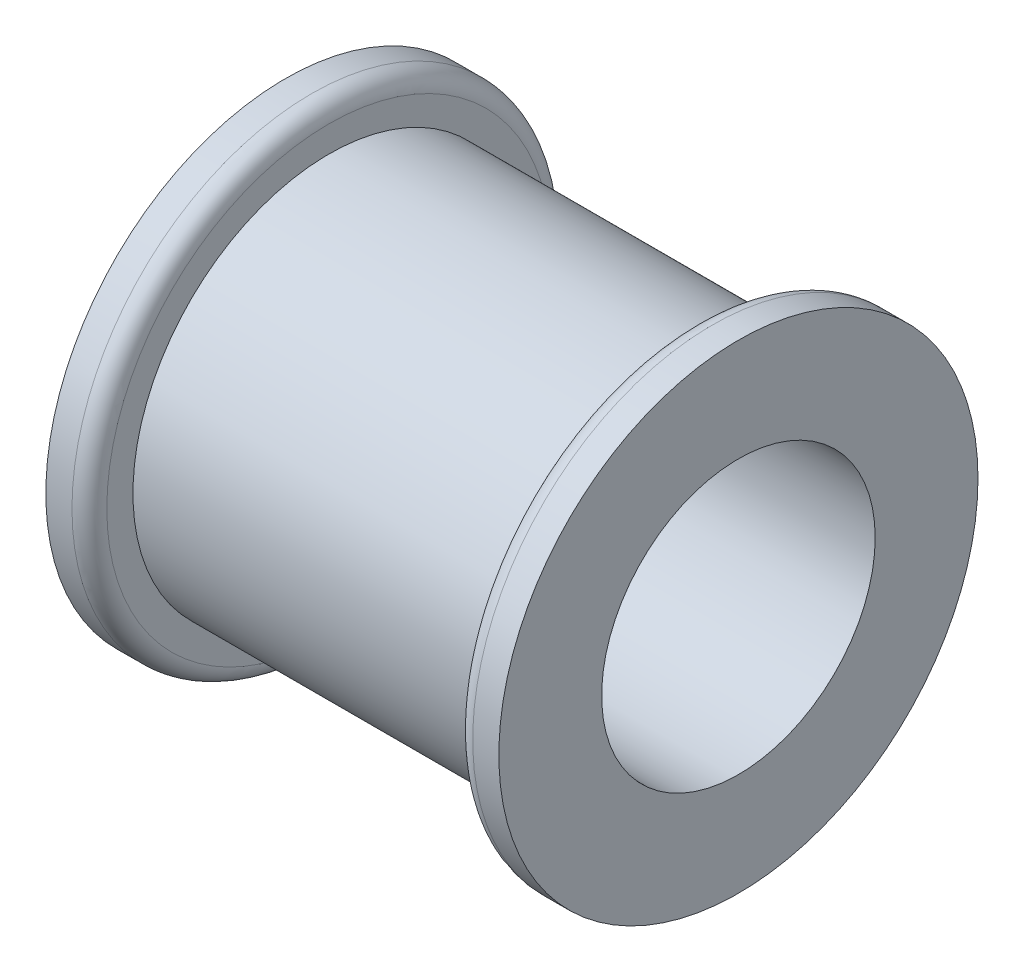
ISO-10303-21;
HEADER;
FILE_DESCRIPTION(('STEP AP214'),'2;1');
FILE_NAME('part.step','',(''),(''),'','','');
FILE_SCHEMA(('AUTOMOTIVE_DESIGN { 1 0 10303 214 1 1 1 1 }'));
ENDSEC;
DATA;
#1=APPLICATION_CONTEXT('core data for automotive mechanical design processes');
#2=APPLICATION_PROTOCOL_DEFINITION('international standard','automotive_design',2000,#1);
#3=PRODUCT_CONTEXT('',#1,'mechanical');
#4=PRODUCT('Part','Part','',(#3));
#5=PRODUCT_RELATED_PRODUCT_CATEGORY('part','',(#4));
#6=PRODUCT_DEFINITION_FORMATION('','',#4);
#7=PRODUCT_DEFINITION_CONTEXT('part definition',#1,'design');
#8=PRODUCT_DEFINITION('design','',#6,#7);
#9=PRODUCT_DEFINITION_SHAPE('','',#8);
#10=(LENGTH_UNIT() NAMED_UNIT(*) SI_UNIT(.MILLI.,.METRE.));
#11=(NAMED_UNIT(*) PLANE_ANGLE_UNIT() SI_UNIT($,.RADIAN.));
#12=(NAMED_UNIT(*) SI_UNIT($,.STERADIAN.) SOLID_ANGLE_UNIT());
#13=UNCERTAINTY_MEASURE_WITH_UNIT(LENGTH_MEASURE(1.E-05),#10,'distance_accuracy_value','');
#14=(GEOMETRIC_REPRESENTATION_CONTEXT(3) GLOBAL_UNCERTAINTY_ASSIGNED_CONTEXT((#13)) GLOBAL_UNIT_ASSIGNED_CONTEXT((#10,
#11,#12)) REPRESENTATION_CONTEXT('',''));
#15=CARTESIAN_POINT('',(0.,0.,0.));
#16=DIRECTION('',(0.,0.,1.));
#17=DIRECTION('',(1.,0.,0.));
#18=AXIS2_PLACEMENT_3D('',#15,#16,#17);
#19=CARTESIAN_POINT('',(26.67,0.,0.));
#20=DIRECTION('',(-1.,0.,0.));
#21=DIRECTION('',(0.,0.,1.));
#22=AXIS2_PLACEMENT_3D('',#19,#20,#21);
#23=CYLINDRICAL_SURFACE('',#22,14.2875);
#24=CARTESIAN_POINT('',(26.67,0.,0.));
#25=DIRECTION('',(1.,0.,0.));
#26=DIRECTION('',(0.,0.,-1.));
#27=AXIS2_PLACEMENT_3D('',#24,#25,#26);
#28=CIRCLE('',#27,14.2875);
#29=CARTESIAN_POINT('',(26.67,0.,-14.2875));
#30=VERTEX_POINT('',#29);
#31=EDGE_CURVE('E50',#30,#30,#28,.T.);
#32=ORIENTED_EDGE('',*,*,#31,.F.);
#33=EDGE_LOOP('',(#32));
#34=FACE_BOUND('',#33,.T.);
#35=CARTESIAN_POINT('',(0.,0.,0.));
#36=DIRECTION('',(1.,0.,0.));
#37=DIRECTION('',(0.,0.,-1.));
#38=AXIS2_PLACEMENT_3D('',#35,#36,#37);
#39=CIRCLE('',#38,14.2875);
#40=CARTESIAN_POINT('',(0.,0.,-14.2875));
#41=VERTEX_POINT('',#40);
#42=EDGE_CURVE('E51',#41,#41,#39,.T.);
#43=ORIENTED_EDGE('',*,*,#42,.T.);
#44=EDGE_LOOP('',(#43));
#45=FACE_BOUND('',#44,.T.);
#46=ADVANCED_FACE('F30',(#34,#45),#23,.T.);
#47=CARTESIAN_POINT('',(26.67,0.,0.));
#48=DIRECTION('',(-1.,0.,0.));
#49=DIRECTION('',(0.,0.,1.));
#50=AXIS2_PLACEMENT_3D('',#47,#48,#49);
#51=CYLINDRICAL_SURFACE('',#50,9.9695);
#52=CARTESIAN_POINT('',(29.845,0.,0.));
#53=DIRECTION('',(1.,0.,0.));
#54=DIRECTION('',(0.,0.,-1.));
#55=AXIS2_PLACEMENT_3D('',#52,#53,#54);
#56=CIRCLE('',#55,9.9695);
#57=CARTESIAN_POINT('',(29.845,0.,-9.9695));
#58=VERTEX_POINT('',#57);
#59=EDGE_CURVE('E54',#58,#58,#56,.T.);
#60=ORIENTED_EDGE('',*,*,#59,.T.);
#61=EDGE_LOOP('',(#60));
#62=FACE_BOUND('',#61,.T.);
#63=CARTESIAN_POINT('',(-3.175,0.,0.));
#64=DIRECTION('',(1.,0.,0.));
#65=DIRECTION('',(0.,0.,-1.));
#66=AXIS2_PLACEMENT_3D('',#63,#64,#65);
#67=CIRCLE('',#66,9.9695);
#68=CARTESIAN_POINT('',(-3.175,0.,-9.9695));
#69=VERTEX_POINT('',#68);
#70=EDGE_CURVE('E65',#69,#69,#67,.T.);
#71=ORIENTED_EDGE('',*,*,#70,.F.);
#72=EDGE_LOOP('',(#71));
#73=FACE_BOUND('',#72,.T.);
#74=ADVANCED_FACE('F72',(#62,#73),#51,.F.);
#75=CARTESIAN_POINT('',(29.845,0.,0.));
#76=DIRECTION('',(1.,0.,0.));
#77=DIRECTION('',(0.,0.,-1.));
#78=AXIS2_PLACEMENT_3D('',#75,#76,#77);
#79=PLANE('',#78);
#80=CARTESIAN_POINT('',(29.845,0.,0.));
#81=DIRECTION('',(1.,0.,0.));
#82=DIRECTION('',(0.,0.,-1.));
#83=AXIS2_PLACEMENT_3D('',#80,#81,#82);
#84=CIRCLE('',#83,17.4625);
#85=CARTESIAN_POINT('',(29.845,0.,-17.4625));
#86=VERTEX_POINT('',#85);
#87=EDGE_CURVE('E58',#86,#86,#84,.T.);
#88=ORIENTED_EDGE('',*,*,#87,.T.);
#89=EDGE_LOOP('',(#88));
#90=FACE_BOUND('',#89,.T.);
#91=ORIENTED_EDGE('',*,*,#59,.F.);
#92=EDGE_LOOP('',(#91));
#93=FACE_BOUND('',#92,.T.);
#94=ADVANCED_FACE('F74',(#90,#93),#79,.T.);
#95=CARTESIAN_POINT('',(26.67,0.,0.));
#96=DIRECTION('',(1.,0.,0.));
#97=DIRECTION('',(0.,0.,-1.));
#98=AXIS2_PLACEMENT_3D('',#95,#96,#97);
#99=PLANE('',#98);
#100=CARTESIAN_POINT('',(26.67,0.,0.));
#101=DIRECTION('',(1.,0.,0.));
#102=DIRECTION('',(0.,0.,-1.));
#103=AXIS2_PLACEMENT_3D('',#100,#101,#102);
#104=CIRCLE('',#103,16.1925);
#105=CARTESIAN_POINT('',(26.67,0.,-16.1925));
#106=VERTEX_POINT('',#105);
#107=EDGE_CURVE('E41',#106,#106,#104,.F.);
#108=ORIENTED_EDGE('',*,*,#107,.T.);
#109=EDGE_LOOP('',(#108));
#110=FACE_BOUND('',#109,.T.);
#111=ORIENTED_EDGE('',*,*,#31,.T.);
#112=EDGE_LOOP('',(#111));
#113=FACE_BOUND('',#112,.T.);
#114=ADVANCED_FACE('F81',(#110,#113),#99,.F.);
#115=CARTESIAN_POINT('',(29.845,0.,0.));
#116=DIRECTION('',(-1.,0.,0.));
#117=DIRECTION('',(0.,0.,1.));
#118=AXIS2_PLACEMENT_3D('',#115,#116,#117);
#119=CYLINDRICAL_SURFACE('',#118,17.4625);
#120=CARTESIAN_POINT('',(27.94,0.,0.));
#121=DIRECTION('',(1.,0.,0.));
#122=DIRECTION('',(0.,0.,-1.));
#123=AXIS2_PLACEMENT_3D('',#120,#121,#122);
#124=CIRCLE('',#123,17.4625);
#125=CARTESIAN_POINT('',(27.94,0.,-17.4625));
#126=VERTEX_POINT('',#125);
#127=EDGE_CURVE('E45',#126,#126,#124,.T.);
#128=ORIENTED_EDGE('',*,*,#127,.T.);
#129=EDGE_LOOP('',(#128));
#130=FACE_BOUND('',#129,.T.);
#131=ORIENTED_EDGE('',*,*,#87,.F.);
#132=EDGE_LOOP('',(#131));
#133=FACE_BOUND('',#132,.T.);
#134=ADVANCED_FACE('F87',(#130,#133),#119,.T.);
#135=CARTESIAN_POINT('',(27.94,0.,0.));
#136=DIRECTION('',(1.,0.,0.));
#137=DIRECTION('',(0.,0.,-1.));
#138=AXIS2_PLACEMENT_3D('',#135,#136,#137);
#139=TOROIDAL_SURFACE('',#138,16.1925,1.27);
#140=ORIENTED_EDGE('',*,*,#107,.F.);
#141=EDGE_LOOP('',(#140));
#142=FACE_BOUND('',#141,.T.);
#143=ORIENTED_EDGE('',*,*,#127,.F.);
#144=EDGE_LOOP('',(#143));
#145=FACE_BOUND('',#144,.T.);
#146=ADVANCED_FACE('F89',(#142,#145),#139,.T.);
#147=CARTESIAN_POINT('',(-3.175,0.,0.));
#148=DIRECTION('',(1.,0.,0.));
#149=DIRECTION('',(0.,0.,-1.));
#150=AXIS2_PLACEMENT_3D('',#147,#148,#149);
#151=CYLINDRICAL_SURFACE('',#150,17.4625);
#152=CARTESIAN_POINT('',(-1.27,0.,0.));
#153=DIRECTION('',(-1.,0.,0.));
#154=DIRECTION('',(0.,0.,1.));
#155=AXIS2_PLACEMENT_3D('',#152,#153,#154);
#156=CIRCLE('',#155,17.4625);
#157=CARTESIAN_POINT('',(-1.27,0.,17.4625));
#158=VERTEX_POINT('',#157);
#159=EDGE_CURVE('E10',#158,#158,#156,.T.);
#160=ORIENTED_EDGE('',*,*,#159,.T.);
#161=EDGE_LOOP('',(#160));
#162=FACE_BOUND('',#161,.T.);
#163=CARTESIAN_POINT('',(-3.175,0.,0.));
#164=DIRECTION('',(1.,0.,0.));
#165=DIRECTION('',(0.,0.,-1.));
#166=AXIS2_PLACEMENT_3D('',#163,#164,#165);
#167=CIRCLE('',#166,17.4625);
#168=CARTESIAN_POINT('',(-3.175,0.,-17.4625));
#169=VERTEX_POINT('',#168);
#170=EDGE_CURVE('E55',#169,#169,#167,.T.);
#171=ORIENTED_EDGE('',*,*,#170,.T.);
#172=EDGE_LOOP('',(#171));
#173=FACE_BOUND('',#172,.T.);
#174=ADVANCED_FACE('F91',(#162,#173),#151,.T.);
#175=CARTESIAN_POINT('',(-3.175,0.,0.));
#176=DIRECTION('',(-1.,0.,0.));
#177=DIRECTION('',(0.,0.,-1.));
#178=AXIS2_PLACEMENT_3D('',#175,#176,#177);
#179=PLANE('',#178);
#180=ORIENTED_EDGE('',*,*,#70,.T.);
#181=EDGE_LOOP('',(#180));
#182=FACE_BOUND('',#181,.T.);
#183=ORIENTED_EDGE('',*,*,#170,.F.);
#184=EDGE_LOOP('',(#183));
#185=FACE_BOUND('',#184,.T.);
#186=ADVANCED_FACE('F69',(#182,#185),#179,.T.);
#187=CARTESIAN_POINT('',(0.,0.,0.));
#188=DIRECTION('',(-1.,0.,0.));
#189=DIRECTION('',(0.,0.,-1.));
#190=AXIS2_PLACEMENT_3D('',#187,#188,#189);
#191=PLANE('',#190);
#192=CARTESIAN_POINT('',(0.,0.,0.));
#193=DIRECTION('',(-1.,0.,0.));
#194=DIRECTION('',(0.,0.,1.));
#195=AXIS2_PLACEMENT_3D('',#192,#193,#194);
#196=CIRCLE('',#195,16.1925);
#197=CARTESIAN_POINT('',(0.,0.,16.1925));
#198=VERTEX_POINT('',#197);
#199=EDGE_CURVE('E37',#198,#198,#196,.F.);
#200=ORIENTED_EDGE('',*,*,#199,.T.);
#201=EDGE_LOOP('',(#200));
#202=FACE_BOUND('',#201,.T.);
#203=ORIENTED_EDGE('',*,*,#42,.F.);
#204=EDGE_LOOP('',(#203));
#205=FACE_BOUND('',#204,.T.);
#206=ADVANCED_FACE('F113',(#202,#205),#191,.F.);
#207=CARTESIAN_POINT('',(-1.27,0.,0.));
#208=DIRECTION('',(-1.,0.,0.));
#209=DIRECTION('',(0.,0.,1.));
#210=AXIS2_PLACEMENT_3D('',#207,#208,#209);
#211=TOROIDAL_SURFACE('',#210,16.1925,1.27);
#212=ORIENTED_EDGE('',*,*,#159,.F.);
#213=EDGE_LOOP('',(#212));
#214=FACE_BOUND('',#213,.T.);
#215=ORIENTED_EDGE('',*,*,#199,.F.);
#216=EDGE_LOOP('',(#215));
#217=FACE_BOUND('',#216,.T.);
#218=ADVANCED_FACE('F32',(#214,#217),#211,.T.);
#219=CLOSED_SHELL('',(#46,#74,#94,#114,#134,#146,#174,#186,#206,#218));
#220=MANIFOLD_SOLID_BREP('B2',#219);
#221=ADVANCED_BREP_SHAPE_REPRESENTATION('',(#18,#220),#14);
#222=SHAPE_DEFINITION_REPRESENTATION(#9,#221);
ENDSEC;
END-ISO-10303-21;
